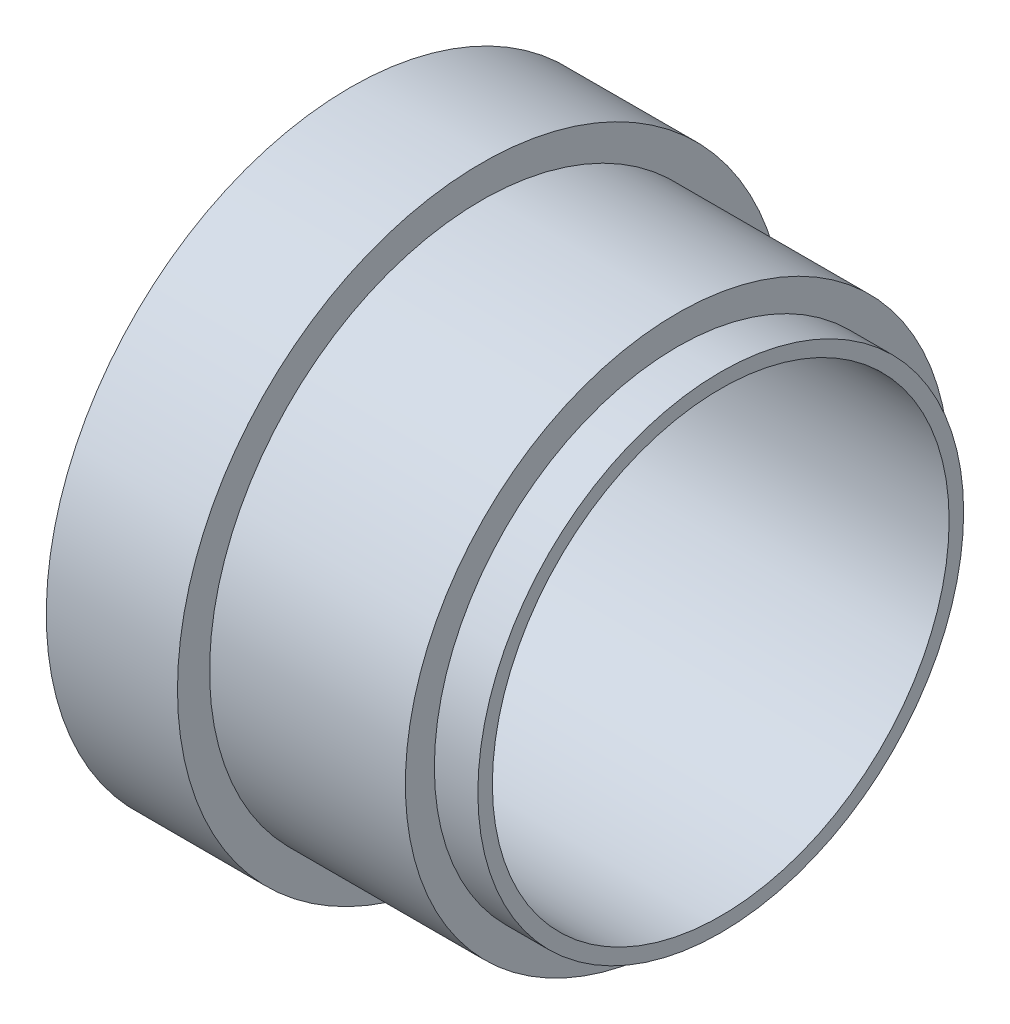
ISO-10303-21;
HEADER;
FILE_DESCRIPTION(('STEP AP214'),'2;1');
FILE_NAME('part.step','',(''),(''),'','','');
FILE_SCHEMA(('AUTOMOTIVE_DESIGN { 1 0 10303 214 1 1 1 1 }'));
ENDSEC;
DATA;
#1=APPLICATION_CONTEXT('core data for automotive mechanical design processes');
#2=APPLICATION_PROTOCOL_DEFINITION('international standard','automotive_design',2000,#1);
#3=PRODUCT_CONTEXT('',#1,'mechanical');
#4=PRODUCT('Part','Part','',(#3));
#5=PRODUCT_RELATED_PRODUCT_CATEGORY('part','',(#4));
#6=PRODUCT_DEFINITION_FORMATION('','',#4);
#7=PRODUCT_DEFINITION_CONTEXT('part definition',#1,'design');
#8=PRODUCT_DEFINITION('design','',#6,#7);
#9=PRODUCT_DEFINITION_SHAPE('','',#8);
#10=(LENGTH_UNIT() NAMED_UNIT(*) SI_UNIT(.MILLI.,.METRE.));
#11=(NAMED_UNIT(*) PLANE_ANGLE_UNIT() SI_UNIT($,.RADIAN.));
#12=(NAMED_UNIT(*) SI_UNIT($,.STERADIAN.) SOLID_ANGLE_UNIT());
#13=UNCERTAINTY_MEASURE_WITH_UNIT(LENGTH_MEASURE(1.E-05),#10,'distance_accuracy_value','');
#14=(GEOMETRIC_REPRESENTATION_CONTEXT(3) GLOBAL_UNCERTAINTY_ASSIGNED_CONTEXT((#13)) GLOBAL_UNIT_ASSIGNED_CONTEXT((#10,
#11,#12)) REPRESENTATION_CONTEXT('',''));
#15=CARTESIAN_POINT('',(0.,0.,0.));
#16=DIRECTION('',(0.,0.,1.));
#17=DIRECTION('',(1.,0.,0.));
#18=AXIS2_PLACEMENT_3D('',#15,#16,#17);
#19=CARTESIAN_POINT('',(4.67199999999551,10.0875000000012,0.));
#20=DIRECTION('',(1.,0.,0.));
#21=DIRECTION('',(0.,0.,-1.));
#22=AXIS2_PLACEMENT_3D('',#19,#20,#21);
#23=PLANE('',#22);
#24=CARTESIAN_POINT('',(4.67199999999551,0.,0.));
#25=DIRECTION('',(1.,0.,0.));
#26=DIRECTION('',(0.,0.,-1.));
#27=AXIS2_PLACEMENT_3D('',#24,#25,#26);
#28=CIRCLE('',#27,9.52500000000094);
#29=CARTESIAN_POINT('',(4.67199999999551,0.,-9.52500000000094));
#30=VERTEX_POINT('',#29);
#31=EDGE_CURVE('E44',#30,#30,#28,.T.);
#32=ORIENTED_EDGE('',*,*,#31,.F.);
#33=EDGE_LOOP('',(#32));
#34=FACE_BOUND('',#33,.T.);
#35=CARTESIAN_POINT('',(4.67199999999551,0.,0.));
#36=DIRECTION('',(1.,0.,0.));
#37=DIRECTION('',(0.,0.,-1.));
#38=AXIS2_PLACEMENT_3D('',#35,#36,#37);
#39=CIRCLE('',#38,10.6500000000014);
#40=CARTESIAN_POINT('',(4.67199999999551,0.,-10.6500000000014));
#41=VERTEX_POINT('',#40);
#42=EDGE_CURVE('E17',#41,#41,#39,.F.);
#43=ORIENTED_EDGE('',*,*,#42,.F.);
#44=EDGE_LOOP('',(#43));
#45=FACE_BOUND('',#44,.T.);
#46=ADVANCED_FACE('F14',(#34,#45),#23,.T.);
#47=CARTESIAN_POINT('',(2.37397767569528,0.,0.));
#48=DIRECTION('',(1.,0.,0.));
#49=DIRECTION('',(0.,0.,-1.));
#50=AXIS2_PLACEMENT_3D('',#47,#48,#49);
#51=CYLINDRICAL_SURFACE('',#50,10.6500000000014);
#52=CARTESIAN_POINT('',(0.0759553524420668,0.,0.));
#53=DIRECTION('',(1.,0.,0.));
#54=DIRECTION('',(0.,1.,0.));
#55=AXIS2_PLACEMENT_3D('',#52,#53,#54);
#56=CIRCLE('',#55,10.6499999996203);
#57=CARTESIAN_POINT('',(0.0759553524420667,10.6499999996203,0.));
#58=VERTEX_POINT('',#57);
#59=EDGE_CURVE('E43',#58,#58,#56,.F.);
#60=ORIENTED_EDGE('',*,*,#59,.F.);
#61=EDGE_LOOP('',(#60));
#62=FACE_BOUND('',#61,.T.);
#63=ORIENTED_EDGE('',*,*,#42,.T.);
#64=EDGE_LOOP('',(#63));
#65=FACE_BOUND('',#64,.T.);
#66=ADVANCED_FACE('F52',(#62,#65),#51,.T.);
#67=CARTESIAN_POINT('',(8.10099999999597,0.,0.));
#68=DIRECTION('',(1.,0.,0.));
#69=DIRECTION('',(0.,0.,-1.));
#70=AXIS2_PLACEMENT_3D('',#67,#68,#69);
#71=CYLINDRICAL_SURFACE('',#70,9.52500000000094);
#72=ORIENTED_EDGE('',*,*,#31,.T.);
#73=EDGE_LOOP('',(#72));
#74=FACE_BOUND('',#73,.T.);
#75=CARTESIAN_POINT('',(11.5299999999965,0.,0.));
#76=DIRECTION('',(1.,0.,0.));
#77=DIRECTION('',(0.,0.,-1.));
#78=AXIS2_PLACEMENT_3D('',#75,#76,#77);
#79=CIRCLE('',#78,9.52500000000094);
#80=CARTESIAN_POINT('',(11.5299999999965,0.,-9.52500000000094));
#81=VERTEX_POINT('',#80);
#82=EDGE_CURVE('E41',#81,#81,#79,.T.);
#83=ORIENTED_EDGE('',*,*,#82,.F.);
#84=EDGE_LOOP('',(#83));
#85=FACE_BOUND('',#84,.T.);
#86=ADVANCED_FACE('F60',(#74,#85),#71,.T.);
#87=CARTESIAN_POINT('',(0.0759553524420665,0.,0.));
#88=DIRECTION('',(1.,0.,0.));
#89=DIRECTION('',(0.,0.,-1.));
#90=AXIS2_PLACEMENT_3D('',#87,#88,#89);
#91=CONICAL_SURFACE('',#90,10.6499999996203,1.22173047500332);
#92=CARTESIAN_POINT('',(-0.469999999999111,0.,0.));
#93=DIRECTION('',(1.,0.,0.));
#94=DIRECTION('',(0.,0.,-1.));
#95=AXIS2_PLACEMENT_3D('',#92,#93,#94);
#96=CIRCLE('',#95,9.15000000000005);
#97=CARTESIAN_POINT('',(-0.469999999999111,0.,-9.15000000000005));
#98=VERTEX_POINT('',#97);
#99=EDGE_CURVE('E40',#98,#98,#96,.T.);
#100=ORIENTED_EDGE('',*,*,#99,.T.);
#101=EDGE_LOOP('',(#100));
#102=FACE_BOUND('',#101,.T.);
#103=ORIENTED_EDGE('',*,*,#59,.T.);
#104=EDGE_LOOP('',(#103));
#105=FACE_BOUND('',#104,.T.);
#106=ADVANCED_FACE('F88',(#102,#105),#91,.T.);
#107=CARTESIAN_POINT('',(11.5299999999965,9.01700000000069,0.));
#108=DIRECTION('',(1.,0.,0.));
#109=DIRECTION('',(0.,0.,-1.));
#110=AXIS2_PLACEMENT_3D('',#107,#108,#109);
#111=PLANE('',#110);
#112=CARTESIAN_POINT('',(11.5299999999965,0.,0.));
#113=DIRECTION('',(1.,0.,0.));
#114=DIRECTION('',(0.,0.,-1.));
#115=AXIS2_PLACEMENT_3D('',#112,#113,#114);
#116=CIRCLE('',#115,8.50900000000043);
#117=CARTESIAN_POINT('',(11.5299999999965,0.,-8.50900000000043));
#118=VERTEX_POINT('',#117);
#119=EDGE_CURVE('E37',#118,#118,#116,.T.);
#120=ORIENTED_EDGE('',*,*,#119,.F.);
#121=EDGE_LOOP('',(#120));
#122=FACE_BOUND('',#121,.T.);
#123=ORIENTED_EDGE('',*,*,#82,.T.);
#124=EDGE_LOOP('',(#123));
#125=FACE_BOUND('',#124,.T.);
#126=ADVANCED_FACE('F84',(#122,#125),#111,.T.);
#127=CARTESIAN_POINT('',(-0.234999999999593,0.,0.));
#128=DIRECTION('',(1.,0.,0.));
#129=DIRECTION('',(0.,0.,-1.));
#130=AXIS2_PLACEMENT_3D('',#127,#128,#129);
#131=CYLINDRICAL_SURFACE('',#130,9.15000000000005);
#132=CARTESIAN_POINT('',(0.,0.,0.));
#133=DIRECTION('',(1.,0.,0.));
#134=DIRECTION('',(0.,0.,-1.));
#135=AXIS2_PLACEMENT_3D('',#132,#133,#134);
#136=CIRCLE('',#135,9.15000000000005);
#137=CARTESIAN_POINT('',(0.,0.,-9.15000000000005));
#138=VERTEX_POINT('',#137);
#139=EDGE_CURVE('E34',#138,#138,#136,.F.);
#140=ORIENTED_EDGE('',*,*,#139,.F.);
#141=EDGE_LOOP('',(#140));
#142=FACE_BOUND('',#141,.T.);
#143=ORIENTED_EDGE('',*,*,#99,.F.);
#144=EDGE_LOOP('',(#143));
#145=FACE_BOUND('',#144,.T.);
#146=ADVANCED_FACE('F80',(#142,#145),#131,.F.);
#147=CARTESIAN_POINT('',(12.2919999999981,0.,0.));
#148=DIRECTION('',(1.,0.,0.));
#149=DIRECTION('',(0.,0.,-1.));
#150=AXIS2_PLACEMENT_3D('',#147,#148,#149);
#151=CYLINDRICAL_SURFACE('',#150,8.50900000000043);
#152=ORIENTED_EDGE('',*,*,#119,.T.);
#153=EDGE_LOOP('',(#152));
#154=FACE_BOUND('',#153,.T.);
#155=CARTESIAN_POINT('',(13.0539999999997,0.,0.));
#156=DIRECTION('',(1.,0.,0.));
#157=DIRECTION('',(0.,0.,-1.));
#158=AXIS2_PLACEMENT_3D('',#155,#156,#157);
#159=CIRCLE('',#158,8.50900000000043);
#160=CARTESIAN_POINT('',(13.0539999999997,0.,-8.50900000000043));
#161=VERTEX_POINT('',#160);
#162=EDGE_CURVE('E26',#161,#161,#159,.T.);
#163=ORIENTED_EDGE('',*,*,#162,.F.);
#164=EDGE_LOOP('',(#163));
#165=FACE_BOUND('',#164,.T.);
#166=ADVANCED_FACE('F76',(#154,#165),#151,.T.);
#167=CARTESIAN_POINT('',(0.,8.57550000000034,0.));
#168=DIRECTION('',(-1.,0.,0.));
#169=DIRECTION('',(0.,0.,1.));
#170=AXIS2_PLACEMENT_3D('',#167,#168,#169);
#171=PLANE('',#170);
#172=CARTESIAN_POINT('',(0.,0.,0.));
#173=DIRECTION('',(1.,0.,0.));
#174=DIRECTION('',(0.,0.,-1.));
#175=AXIS2_PLACEMENT_3D('',#172,#173,#174);
#176=CIRCLE('',#175,8.00100000000064);
#177=CARTESIAN_POINT('',(0.,0.,-8.00100000000064));
#178=VERTEX_POINT('',#177);
#179=EDGE_CURVE('E21',#178,#178,#176,.T.);
#180=ORIENTED_EDGE('',*,*,#179,.T.);
#181=EDGE_LOOP('',(#180));
#182=FACE_BOUND('',#181,.T.);
#183=ORIENTED_EDGE('',*,*,#139,.T.);
#184=EDGE_LOOP('',(#183));
#185=FACE_BOUND('',#184,.T.);
#186=ADVANCED_FACE('F70',(#182,#185),#171,.T.);
#187=CARTESIAN_POINT('',(13.0539999999997,8.25500000000053,0.));
#188=DIRECTION('',(1.,0.,0.));
#189=DIRECTION('',(0.,0.,-1.));
#190=AXIS2_PLACEMENT_3D('',#187,#188,#189);
#191=PLANE('',#190);
#192=CARTESIAN_POINT('',(13.0539999999997,0.,0.));
#193=DIRECTION('',(1.,0.,0.));
#194=DIRECTION('',(0.,0.,-1.));
#195=AXIS2_PLACEMENT_3D('',#192,#193,#194);
#196=CIRCLE('',#195,8.00100000000064);
#197=CARTESIAN_POINT('',(13.0539999999997,0.,-8.00100000000064));
#198=VERTEX_POINT('',#197);
#199=EDGE_CURVE('E10',#198,#198,#196,.F.);
#200=ORIENTED_EDGE('',*,*,#199,.T.);
#201=EDGE_LOOP('',(#200));
#202=FACE_BOUND('',#201,.T.);
#203=ORIENTED_EDGE('',*,*,#162,.T.);
#204=EDGE_LOOP('',(#203));
#205=FACE_BOUND('',#204,.T.);
#206=ADVANCED_FACE('F64',(#202,#205),#191,.T.);
#207=CARTESIAN_POINT('',(6.5269999999998,0.,0.));
#208=DIRECTION('',(1.,0.,0.));
#209=DIRECTION('',(0.,0.,-1.));
#210=AXIS2_PLACEMENT_3D('',#207,#208,#209);
#211=CYLINDRICAL_SURFACE('',#210,8.00100000000064);
#212=ORIENTED_EDGE('',*,*,#199,.F.);
#213=EDGE_LOOP('',(#212));
#214=FACE_BOUND('',#213,.T.);
#215=ORIENTED_EDGE('',*,*,#179,.F.);
#216=EDGE_LOOP('',(#215));
#217=FACE_BOUND('',#216,.T.);
#218=ADVANCED_FACE('F62',(#214,#217),#211,.F.);
#219=CLOSED_SHELL('',(#46,#66,#86,#106,#126,#146,#166,#186,#206,#218));
#220=MANIFOLD_SOLID_BREP('B1',#219);
#221=ADVANCED_BREP_SHAPE_REPRESENTATION('',(#18,#220),#14);
#222=SHAPE_DEFINITION_REPRESENTATION(#9,#221);
ENDSEC;
END-ISO-10303-21;
